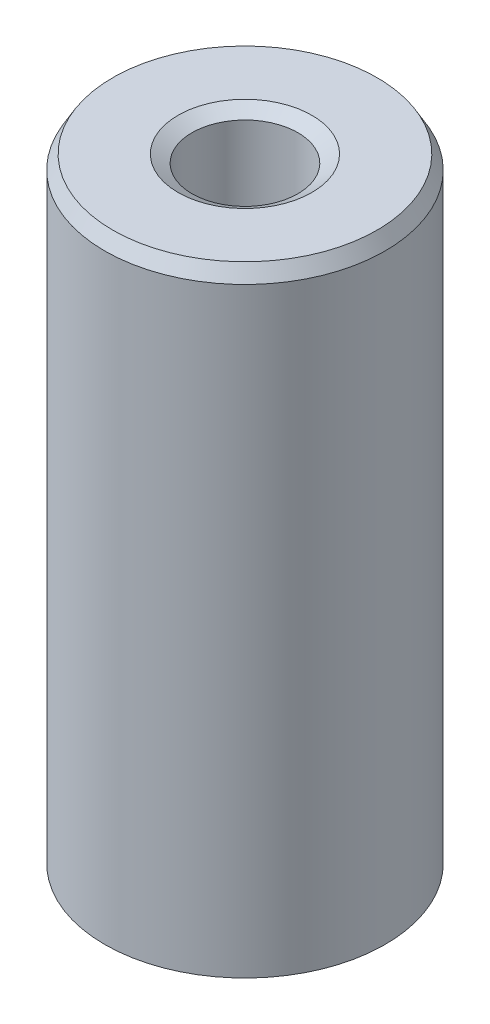
ISO-10303-21;
HEADER;
FILE_DESCRIPTION(('STEP AP214'),'2;1');
FILE_NAME('part.step','',(''),(''),'','','');
FILE_SCHEMA(('AUTOMOTIVE_DESIGN { 1 0 10303 214 1 1 1 1 }'));
ENDSEC;
DATA;
#1=APPLICATION_CONTEXT('core data for automotive mechanical design processes');
#2=APPLICATION_PROTOCOL_DEFINITION('international standard','automotive_design',2000,#1);
#3=PRODUCT_CONTEXT('',#1,'mechanical');
#4=PRODUCT('Part','Part','',(#3));
#5=PRODUCT_RELATED_PRODUCT_CATEGORY('part','',(#4));
#6=PRODUCT_DEFINITION_FORMATION('','',#4);
#7=PRODUCT_DEFINITION_CONTEXT('part definition',#1,'design');
#8=PRODUCT_DEFINITION('design','',#6,#7);
#9=PRODUCT_DEFINITION_SHAPE('','',#8);
#10=(LENGTH_UNIT() NAMED_UNIT(*) SI_UNIT(.MILLI.,.METRE.));
#11=(NAMED_UNIT(*) PLANE_ANGLE_UNIT() SI_UNIT($,.RADIAN.));
#12=(NAMED_UNIT(*) SI_UNIT($,.STERADIAN.) SOLID_ANGLE_UNIT());
#13=UNCERTAINTY_MEASURE_WITH_UNIT(LENGTH_MEASURE(1.E-05),#10,'distance_accuracy_value','');
#14=(GEOMETRIC_REPRESENTATION_CONTEXT(3) GLOBAL_UNCERTAINTY_ASSIGNED_CONTEXT((#13)) GLOBAL_UNIT_ASSIGNED_CONTEXT((#10,
#11,#12)) REPRESENTATION_CONTEXT('',''));
#15=CARTESIAN_POINT('',(0.,0.,0.));
#16=DIRECTION('',(0.,0.,1.));
#17=DIRECTION('',(1.,0.,0.));
#18=AXIS2_PLACEMENT_3D('',#15,#16,#17);
#19=CARTESIAN_POINT('',(0.,55.5131235010194,0.));
#20=DIRECTION('',(0.,-1.,0.));
#21=DIRECTION('',(0.,0.,-1.));
#22=AXIS2_PLACEMENT_3D('',#19,#20,#21);
#23=CYLINDRICAL_SURFACE('',#22,12.5);
#24=CARTESIAN_POINT('',(0.,0.719327048225533,0.));
#25=DIRECTION('',(0.,1.,0.));
#26=DIRECTION('',(0.,0.,1.));
#27=AXIS2_PLACEMENT_3D('',#24,#25,#26);
#28=CIRCLE('',#27,12.5);
#29=CARTESIAN_POINT('',(0.,0.719327048225533,12.5));
#30=VERTEX_POINT('',#29);
#31=EDGE_CURVE('E10',#30,#30,#28,.T.);
#32=ORIENTED_EDGE('',*,*,#31,.T.);
#33=EDGE_LOOP('',(#32));
#34=FACE_BOUND('',#33,.T.);
#35=CARTESIAN_POINT('',(0.,54.2672125062342,0.));
#36=DIRECTION('',(0.,1.,0.));
#37=DIRECTION('',(0.,0.,1.));
#38=AXIS2_PLACEMENT_3D('',#35,#36,#37);
#39=CIRCLE('',#38,12.5);
#40=CARTESIAN_POINT('',(0.,54.2672125062342,12.5));
#41=VERTEX_POINT('',#40);
#42=EDGE_CURVE('E50',#41,#41,#39,.F.);
#43=ORIENTED_EDGE('',*,*,#42,.T.);
#44=EDGE_LOOP('',(#43));
#45=FACE_BOUND('',#44,.T.);
#46=ADVANCED_FACE('F39',(#34,#45),#23,.T.);
#47=CARTESIAN_POINT('',(0.,55.5131235010194,0.));
#48=DIRECTION('',(0.,1.,0.));
#49=DIRECTION('',(0.,0.,1.));
#50=AXIS2_PLACEMENT_3D('',#47,#48,#49);
#51=PLANE('',#50);
#52=CARTESIAN_POINT('',(0.,55.5131235010194,0.));
#53=DIRECTION('',(0.,1.,0.));
#54=DIRECTION('',(0.,0.,1.));
#55=AXIS2_PLACEMENT_3D('',#52,#53,#54);
#56=CIRCLE('',#55,5.96599379112168);
#57=CARTESIAN_POINT('',(0.,55.5131235010194,5.96599379112168));
#58=VERTEX_POINT('',#57);
#59=EDGE_CURVE('E58',#58,#58,#56,.F.);
#60=ORIENTED_EDGE('',*,*,#59,.T.);
#61=EDGE_LOOP('',(#60));
#62=FACE_BOUND('',#61,.T.);
#63=CARTESIAN_POINT('',(0.,55.5131235010194,0.));
#64=DIRECTION('',(0.,1.,0.));
#65=DIRECTION('',(0.,0.,1.));
#66=AXIS2_PLACEMENT_3D('',#63,#64,#65);
#67=CIRCLE('',#66,11.7806729517745);
#68=CARTESIAN_POINT('',(0.,55.5131235010194,11.7806729517745));
#69=VERTEX_POINT('',#68);
#70=EDGE_CURVE('E61',#69,#69,#67,.T.);
#71=ORIENTED_EDGE('',*,*,#70,.T.);
#72=EDGE_LOOP('',(#71));
#73=FACE_BOUND('',#72,.T.);
#74=ADVANCED_FACE('F88',(#62,#73),#51,.T.);
#75=CARTESIAN_POINT('',(0.,0.,0.));
#76=DIRECTION('',(0.,1.,0.));
#77=DIRECTION('',(0.,0.,1.));
#78=AXIS2_PLACEMENT_3D('',#75,#76,#77);
#79=PLANE('',#78);
#80=CARTESIAN_POINT('',(0.,0.,0.));
#81=DIRECTION('',(0.,1.,0.));
#82=DIRECTION('',(0.,0.,1.));
#83=AXIS2_PLACEMENT_3D('',#80,#81,#82);
#84=CIRCLE('',#83,5.43940984456202);
#85=CARTESIAN_POINT('',(0.,0.,5.43940984456202));
#86=VERTEX_POINT('',#85);
#87=EDGE_CURVE('E51',#86,#86,#84,.T.);
#88=ORIENTED_EDGE('',*,*,#87,.T.);
#89=EDGE_LOOP('',(#88));
#90=FACE_BOUND('',#89,.T.);
#91=CARTESIAN_POINT('',(0.,0.,0.));
#92=DIRECTION('',(0.,1.,0.));
#93=DIRECTION('',(0.,0.,1.));
#94=AXIS2_PLACEMENT_3D('',#91,#92,#93);
#95=CIRCLE('',#94,11.2540890052148);
#96=CARTESIAN_POINT('',(0.,0.,11.2540890052148));
#97=VERTEX_POINT('',#96);
#98=EDGE_CURVE('E54',#97,#97,#95,.F.);
#99=ORIENTED_EDGE('',*,*,#98,.T.);
#100=EDGE_LOOP('',(#99));
#101=FACE_BOUND('',#100,.T.);
#102=ADVANCED_FACE('F83',(#90,#101),#79,.F.);
#103=CARTESIAN_POINT('',(0.,55.5131235010194,0.));
#104=DIRECTION('',(0.,-1.,0.));
#105=DIRECTION('',(0.,0.,-1.));
#106=AXIS2_PLACEMENT_3D('',#103,#104,#105);
#107=CYLINDRICAL_SURFACE('',#106,4.72008279633649);
#108=CARTESIAN_POINT('',(0.,54.7937964527938,0.));
#109=DIRECTION('',(0.,1.,0.));
#110=DIRECTION('',(0.,0.,1.));
#111=AXIS2_PLACEMENT_3D('',#108,#109,#110);
#112=CIRCLE('',#111,4.72008279633649);
#113=CARTESIAN_POINT('',(0.,54.7937964527938,4.72008279633649));
#114=VERTEX_POINT('',#113);
#115=EDGE_CURVE('E67',#114,#114,#112,.T.);
#116=ORIENTED_EDGE('',*,*,#115,.T.);
#117=EDGE_LOOP('',(#116));
#118=FACE_BOUND('',#117,.T.);
#119=CARTESIAN_POINT('',(0.,1.24591099478519,0.));
#120=DIRECTION('',(0.,1.,0.));
#121=DIRECTION('',(0.,0.,1.));
#122=AXIS2_PLACEMENT_3D('',#119,#120,#121);
#123=CIRCLE('',#122,4.72008279633649);
#124=CARTESIAN_POINT('',(0.,1.24591099478519,4.72008279633649));
#125=VERTEX_POINT('',#124);
#126=EDGE_CURVE('E69',#125,#125,#123,.F.);
#127=ORIENTED_EDGE('',*,*,#126,.T.);
#128=EDGE_LOOP('',(#127));
#129=FACE_BOUND('',#128,.T.);
#130=ADVANCED_FACE('F71',(#118,#129),#107,.F.);
#131=CARTESIAN_POINT('',(0.,54.7937964527938,0.));
#132=DIRECTION('',(0.,1.,0.));
#133=DIRECTION('',(0.,0.,1.));
#134=AXIS2_PLACEMENT_3D('',#131,#132,#133);
#135=CONICAL_SURFACE('',#134,4.72008279633649,1.0471975511966);
#136=ORIENTED_EDGE('',*,*,#59,.F.);
#137=EDGE_LOOP('',(#136));
#138=FACE_BOUND('',#137,.T.);
#139=ORIENTED_EDGE('',*,*,#115,.F.);
#140=EDGE_LOOP('',(#139));
#141=FACE_BOUND('',#140,.T.);
#142=ADVANCED_FACE('F77',(#138,#141),#135,.F.);
#143=CARTESIAN_POINT('',(0.,0.,0.));
#144=DIRECTION('',(0.,-1.,0.));
#145=DIRECTION('',(0.,0.,-1.));
#146=AXIS2_PLACEMENT_3D('',#143,#144,#145);
#147=CONICAL_SURFACE('',#146,5.43940984456202,0.523598775598293);
#148=ORIENTED_EDGE('',*,*,#126,.F.);
#149=EDGE_LOOP('',(#148));
#150=FACE_BOUND('',#149,.T.);
#151=ORIENTED_EDGE('',*,*,#87,.F.);
#152=EDGE_LOOP('',(#151));
#153=FACE_BOUND('',#152,.T.);
#154=ADVANCED_FACE('F73',(#150,#153),#147,.F.);
#155=CARTESIAN_POINT('',(0.,0.719327048225533,0.));
#156=DIRECTION('',(0.,1.,0.));
#157=DIRECTION('',(0.,0.,1.));
#158=AXIS2_PLACEMENT_3D('',#155,#156,#157);
#159=CONICAL_SURFACE('',#158,12.5,1.0471975511966);
#160=ORIENTED_EDGE('',*,*,#98,.F.);
#161=EDGE_LOOP('',(#160));
#162=FACE_BOUND('',#161,.T.);
#163=ORIENTED_EDGE('',*,*,#31,.F.);
#164=EDGE_LOOP('',(#163));
#165=FACE_BOUND('',#164,.T.);
#166=ADVANCED_FACE('F76',(#162,#165),#159,.T.);
#167=CARTESIAN_POINT('',(0.,55.5131235010194,0.));
#168=DIRECTION('',(0.,-1.,0.));
#169=DIRECTION('',(0.,0.,-1.));
#170=AXIS2_PLACEMENT_3D('',#167,#168,#169);
#171=CONICAL_SURFACE('',#170,11.7806729517745,0.523598775598297);
#172=ORIENTED_EDGE('',*,*,#42,.F.);
#173=EDGE_LOOP('',(#172));
#174=FACE_BOUND('',#173,.T.);
#175=ORIENTED_EDGE('',*,*,#70,.F.);
#176=EDGE_LOOP('',(#175));
#177=FACE_BOUND('',#176,.T.);
#178=ADVANCED_FACE('F45',(#174,#177),#171,.T.);
#179=CLOSED_SHELL('',(#46,#74,#102,#130,#142,#154,#166,#178));
#180=MANIFOLD_SOLID_BREP('B2',#179);
#181=ADVANCED_BREP_SHAPE_REPRESENTATION('',(#18,#180),#14);
#182=SHAPE_DEFINITION_REPRESENTATION(#9,#181);
ENDSEC;
END-ISO-10303-21;
